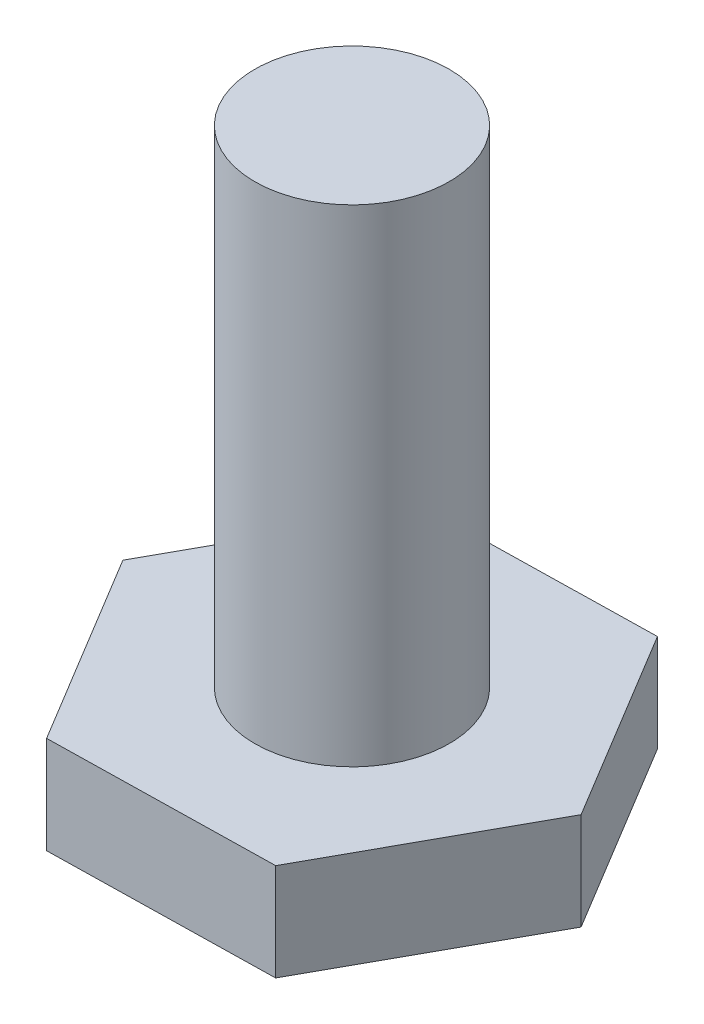
ISO-10303-21;
HEADER;
FILE_DESCRIPTION(('STEP AP214'),'2;1');
FILE_NAME('part.step','',(''),(''),'','','');
FILE_SCHEMA(('AUTOMOTIVE_DESIGN { 1 0 10303 214 1 1 1 1 }'));
ENDSEC;
DATA;
#1=APPLICATION_CONTEXT('core data for automotive mechanical design processes');
#2=APPLICATION_PROTOCOL_DEFINITION('international standard','automotive_design',2000,#1);
#3=PRODUCT_CONTEXT('',#1,'mechanical');
#4=PRODUCT('Part','Part','',(#3));
#5=PRODUCT_RELATED_PRODUCT_CATEGORY('part','',(#4));
#6=PRODUCT_DEFINITION_FORMATION('','',#4);
#7=PRODUCT_DEFINITION_CONTEXT('part definition',#1,'design');
#8=PRODUCT_DEFINITION('design','',#6,#7);
#9=PRODUCT_DEFINITION_SHAPE('','',#8);
#10=(LENGTH_UNIT() NAMED_UNIT(*) SI_UNIT(.MILLI.,.METRE.));
#11=(NAMED_UNIT(*) PLANE_ANGLE_UNIT() SI_UNIT($,.RADIAN.));
#12=(NAMED_UNIT(*) SI_UNIT($,.STERADIAN.) SOLID_ANGLE_UNIT());
#13=UNCERTAINTY_MEASURE_WITH_UNIT(LENGTH_MEASURE(1.E-05),#10,'distance_accuracy_value','');
#14=(GEOMETRIC_REPRESENTATION_CONTEXT(3) GLOBAL_UNCERTAINTY_ASSIGNED_CONTEXT((#13)) GLOBAL_UNIT_ASSIGNED_CONTEXT((#10,
#11,#12)) REPRESENTATION_CONTEXT('',''));
#15=CARTESIAN_POINT('',(0.,0.,0.));
#16=DIRECTION('',(0.,0.,1.));
#17=DIRECTION('',(1.,0.,0.));
#18=AXIS2_PLACEMENT_3D('',#15,#16,#17);
#19=CARTESIAN_POINT('',(-18.8764059971618,10.,12.7106786421223));
#20=DIRECTION('',(0.,-1.,0.));
#21=DIRECTION('',(0.,0.,-1.));
#22=AXIS2_PLACEMENT_3D('',#19,#20,#21);
#23=CYLINDRICAL_SURFACE('',#22,2.);
#24=CARTESIAN_POINT('',(-18.8764059971618,10.,12.7106786421223));
#25=DIRECTION('',(0.,1.,0.));
#26=DIRECTION('',(0.,0.,1.));
#27=AXIS2_PLACEMENT_3D('',#24,#25,#26);
#28=CIRCLE('',#27,2.);
#29=CARTESIAN_POINT('',(-18.8764059971618,10.,14.7106786421223));
#30=VERTEX_POINT('',#29);
#31=EDGE_CURVE('E11',#30,#30,#28,.T.);
#32=ORIENTED_EDGE('',*,*,#31,.F.);
#33=EDGE_LOOP('',(#32));
#34=FACE_BOUND('',#33,.T.);
#35=CARTESIAN_POINT('',(-18.8764059971618,0.,12.7106786421223));
#36=DIRECTION('',(0.,-1.,0.));
#37=DIRECTION('',(0.,0.,-1.));
#38=AXIS2_PLACEMENT_3D('',#35,#36,#37);
#39=CIRCLE('',#38,2.);
#40=CARTESIAN_POINT('',(-18.8764059971618,0.,10.7106786421223));
#41=VERTEX_POINT('',#40);
#42=EDGE_CURVE('E41',#41,#41,#39,.T.);
#43=ORIENTED_EDGE('',*,*,#42,.F.);
#44=EDGE_LOOP('',(#43));
#45=FACE_BOUND('',#44,.T.);
#46=ADVANCED_FACE('F33',(#34,#45),#23,.T.);
#47=CARTESIAN_POINT('',(-18.8764059971618,10.,12.7106786421223));
#48=DIRECTION('',(0.,1.,0.));
#49=DIRECTION('',(0.,0.,1.));
#50=AXIS2_PLACEMENT_3D('',#47,#48,#49);
#51=PLANE('',#50);
#52=ORIENTED_EDGE('',*,*,#31,.T.);
#53=EDGE_LOOP('',(#52));
#54=FACE_BOUND('',#53,.T.);
#55=ADVANCED_FACE('F142',(#54),#51,.T.);
#56=CARTESIAN_POINT('',(-16.4901459386641,0.,16.6653083677163));
#57=DIRECTION('',(0.,-1.,0.));
#58=DIRECTION('',(0.,0.,-1.));
#59=AXIS2_PLACEMENT_3D('',#56,#57,#58);
#60=PLANE('',#59);
#61=DIRECTION('',(-0.483172844711996,0.,0.875524986584002));
#62=VECTOR('',#61,1.);
#63=CARTESIAN_POINT('',(-14.2584661629874,0.,12.6214316742242));
#64=LINE('',#63,#62);
#65=CARTESIAN_POINT('',(-14.2584661629874,0.,12.6214316742242));
#66=VERTEX_POINT('',#65);
#67=CARTESIAN_POINT('',(-16.4901459386641,0.,16.6653083677163));
#68=VERTEX_POINT('',#67);
#69=EDGE_CURVE('E118',#66,#68,#64,.T.);
#70=ORIENTED_EDGE('',*,*,#69,.F.);
#71=DIRECTION('',(0.516640457673778,0.,0.856202451231383));
#72=VECTOR('',#71,1.);
#73=CARTESIAN_POINT('',(-16.6447262214851,0.,8.66680194863014));
#74=LINE('',#73,#72);
#75=CARTESIAN_POINT('',(-16.6447262214851,0.,8.66680194863014));
#76=VERTEX_POINT('',#75);
#77=EDGE_CURVE('E78',#76,#66,#74,.T.);
#78=ORIENTED_EDGE('',*,*,#77,.F.);
#79=DIRECTION('',(0.999813302385774,0.,-0.0193225353526195));
#80=VECTOR('',#79,1.);
#81=CARTESIAN_POINT('',(-21.2626660556594,0.,8.75604891652822));
#82=LINE('',#81,#80);
#83=CARTESIAN_POINT('',(-21.2626660556594,0.,8.75604891652822));
#84=VERTEX_POINT('',#83);
#85=EDGE_CURVE('E72',#84,#76,#82,.T.);
#86=ORIENTED_EDGE('',*,*,#85,.F.);
#87=DIRECTION('',(0.483172844711996,0.,-0.875524986584002));
#88=VECTOR('',#87,1.);
#89=CARTESIAN_POINT('',(-23.4943458313361,0.,12.7999256100204));
#90=LINE('',#89,#88);
#91=CARTESIAN_POINT('',(-23.4943458313361,0.,12.7999256100204));
#92=VERTEX_POINT('',#91);
#93=EDGE_CURVE('E108',#92,#84,#90,.T.);
#94=ORIENTED_EDGE('',*,*,#93,.F.);
#95=DIRECTION('',(-0.516640457673778,0.,-0.856202451231383));
#96=VECTOR('',#95,1.);
#97=CARTESIAN_POINT('',(-21.1080857728385,0.,16.7545553356144));
#98=LINE('',#97,#96);
#99=CARTESIAN_POINT('',(-21.1080857728385,0.,16.7545553356144));
#100=VERTEX_POINT('',#99);
#101=EDGE_CURVE('E123',#100,#92,#98,.T.);
#102=ORIENTED_EDGE('',*,*,#101,.F.);
#103=DIRECTION('',(-0.999813302385774,0.,0.0193225353526199));
#104=VECTOR('',#103,1.);
#105=CARTESIAN_POINT('',(-16.4901459386641,0.,16.6653083677163));
#106=LINE('',#105,#104);
#107=EDGE_CURVE('E121',#68,#100,#106,.T.);
#108=ORIENTED_EDGE('',*,*,#107,.F.);
#109=EDGE_LOOP('',(#70,#78,#86,#94,#102,#108));
#110=FACE_BOUND('',#109,.T.);
#111=ORIENTED_EDGE('',*,*,#42,.T.);
#112=EDGE_LOOP('',(#111));
#113=FACE_BOUND('',#112,.T.);
#114=ADVANCED_FACE('F139',(#110,#113),#60,.F.);
#115=CARTESIAN_POINT('',(-14.2584661629874,-2.,12.6214316742242));
#116=DIRECTION('',(-0.875524986584002,0.,-0.483172844711996));
#117=DIRECTION('',(-0.483172844711996,0.,0.875524986584002));
#118=AXIS2_PLACEMENT_3D('',#115,#116,#117);
#119=PLANE('',#118);
#120=ORIENTED_EDGE('',*,*,#69,.T.);
#121=DIRECTION('',(0.,1.,0.));
#122=VECTOR('',#121,1.);
#123=CARTESIAN_POINT('',(-16.4901459386641,-2.,16.6653083677163));
#124=LINE('',#123,#122);
#125=CARTESIAN_POINT('',(-16.4901459386641,-2.,16.6653083677163));
#126=VERTEX_POINT('',#125);
#127=EDGE_CURVE('E135',#126,#68,#124,.T.);
#128=ORIENTED_EDGE('',*,*,#127,.F.);
#129=DIRECTION('',(-0.483172844711996,0.,0.875524986584002));
#130=VECTOR('',#129,1.);
#131=CARTESIAN_POINT('',(-14.2584661629874,-2.,12.6214316742242));
#132=LINE('',#131,#130);
#133=CARTESIAN_POINT('',(-14.2584661629874,-2.,12.6214316742242));
#134=VERTEX_POINT('',#133);
#135=EDGE_CURVE('E128',#134,#126,#132,.T.);
#136=ORIENTED_EDGE('',*,*,#135,.F.);
#137=DIRECTION('',(0.,1.,0.));
#138=VECTOR('',#137,1.);
#139=CARTESIAN_POINT('',(-14.2584661629874,-2.,12.6214316742242));
#140=LINE('',#139,#138);
#141=EDGE_CURVE('E114',#134,#66,#140,.T.);
#142=ORIENTED_EDGE('',*,*,#141,.T.);
#143=EDGE_LOOP('',(#120,#128,#136,#142));
#144=FACE_BOUND('',#143,.T.);
#145=ADVANCED_FACE('F152',(#144),#119,.F.);
#146=CARTESIAN_POINT('',(-16.4901459386641,-2.,16.6653083677163));
#147=DIRECTION('',(-0.0193225353526199,0.,-0.999813302385774));
#148=DIRECTION('',(-0.999813302385774,0.,0.0193225353526199));
#149=AXIS2_PLACEMENT_3D('',#146,#147,#148);
#150=PLANE('',#149);
#151=ORIENTED_EDGE('',*,*,#107,.T.);
#152=DIRECTION('',(0.,1.,0.));
#153=VECTOR('',#152,1.);
#154=CARTESIAN_POINT('',(-21.1080857728385,-2.,16.7545553356144));
#155=LINE('',#154,#153);
#156=CARTESIAN_POINT('',(-21.1080857728385,-2.,16.7545553356144));
#157=VERTEX_POINT('',#156);
#158=EDGE_CURVE('E132',#157,#100,#155,.T.);
#159=ORIENTED_EDGE('',*,*,#158,.F.);
#160=DIRECTION('',(-0.999813302385774,0.,0.0193225353526199));
#161=VECTOR('',#160,1.);
#162=CARTESIAN_POINT('',(-16.4901459386641,-2.,16.6653083677163));
#163=LINE('',#162,#161);
#164=EDGE_CURVE('E87',#126,#157,#163,.T.);
#165=ORIENTED_EDGE('',*,*,#164,.F.);
#166=ORIENTED_EDGE('',*,*,#127,.T.);
#167=EDGE_LOOP('',(#151,#159,#165,#166));
#168=FACE_BOUND('',#167,.T.);
#169=ADVANCED_FACE('F158',(#168),#150,.F.);
#170=CARTESIAN_POINT('',(-21.1080857728385,-2.,16.7545553356144));
#171=DIRECTION('',(0.856202451231383,0.,-0.516640457673778));
#172=DIRECTION('',(-0.516640457673778,0.,-0.856202451231383));
#173=AXIS2_PLACEMENT_3D('',#170,#171,#172);
#174=PLANE('',#173);
#175=ORIENTED_EDGE('',*,*,#101,.T.);
#176=DIRECTION('',(0.,1.,0.));
#177=VECTOR('',#176,1.);
#178=CARTESIAN_POINT('',(-23.4943458313361,-2.,12.7999256100204));
#179=LINE('',#178,#177);
#180=CARTESIAN_POINT('',(-23.4943458313361,-2.,12.7999256100204));
#181=VERTEX_POINT('',#180);
#182=EDGE_CURVE('E109',#181,#92,#179,.T.);
#183=ORIENTED_EDGE('',*,*,#182,.F.);
#184=DIRECTION('',(-0.516640457673778,0.,-0.856202451231383));
#185=VECTOR('',#184,1.);
#186=CARTESIAN_POINT('',(-21.1080857728385,-2.,16.7545553356144));
#187=LINE('',#186,#185);
#188=EDGE_CURVE('E100',#157,#181,#187,.T.);
#189=ORIENTED_EDGE('',*,*,#188,.F.);
#190=ORIENTED_EDGE('',*,*,#158,.T.);
#191=EDGE_LOOP('',(#175,#183,#189,#190));
#192=FACE_BOUND('',#191,.T.);
#193=ADVANCED_FACE('F162',(#192),#174,.F.);
#194=CARTESIAN_POINT('',(-23.4943458313361,-2.,12.7999256100204));
#195=DIRECTION('',(0.875524986584002,0.,0.483172844711996));
#196=DIRECTION('',(0.483172844711996,0.,-0.875524986584003));
#197=AXIS2_PLACEMENT_3D('',#194,#195,#196);
#198=PLANE('',#197);
#199=ORIENTED_EDGE('',*,*,#93,.T.);
#200=DIRECTION('',(0.,1.,0.));
#201=VECTOR('',#200,1.);
#202=CARTESIAN_POINT('',(-21.2626660556594,-2.,8.75604891652822));
#203=LINE('',#202,#201);
#204=CARTESIAN_POINT('',(-21.2626660556594,-2.,8.75604891652822));
#205=VERTEX_POINT('',#204);
#206=EDGE_CURVE('E105',#205,#84,#203,.T.);
#207=ORIENTED_EDGE('',*,*,#206,.F.);
#208=DIRECTION('',(0.483172844711996,0.,-0.875524986584002));
#209=VECTOR('',#208,1.);
#210=CARTESIAN_POINT('',(-23.4943458313361,-2.,12.7999256100204));
#211=LINE('',#210,#209);
#212=EDGE_CURVE('E94',#181,#205,#211,.T.);
#213=ORIENTED_EDGE('',*,*,#212,.F.);
#214=ORIENTED_EDGE('',*,*,#182,.T.);
#215=EDGE_LOOP('',(#199,#207,#213,#214));
#216=FACE_BOUND('',#215,.T.);
#217=ADVANCED_FACE('F106',(#216),#198,.F.);
#218=CARTESIAN_POINT('',(-21.2626660556594,-2.,8.75604891652822));
#219=DIRECTION('',(0.0193225353526195,0.,0.999813302385774));
#220=DIRECTION('',(0.999813302385774,0.,-0.0193225353526195));
#221=AXIS2_PLACEMENT_3D('',#218,#219,#220);
#222=PLANE('',#221);
#223=ORIENTED_EDGE('',*,*,#85,.T.);
#224=DIRECTION('',(0.,1.,0.));
#225=VECTOR('',#224,1.);
#226=CARTESIAN_POINT('',(-16.6447262214851,-2.,8.66680194863014));
#227=LINE('',#226,#225);
#228=CARTESIAN_POINT('',(-16.6447262214851,-2.,8.66680194863014));
#229=VERTEX_POINT('',#228);
#230=EDGE_CURVE('E110',#229,#76,#227,.T.);
#231=ORIENTED_EDGE('',*,*,#230,.F.);
#232=DIRECTION('',(0.999813302385774,0.,-0.0193225353526195));
#233=VECTOR('',#232,1.);
#234=CARTESIAN_POINT('',(-21.2626660556594,-2.,8.75604891652822));
#235=LINE('',#234,#233);
#236=EDGE_CURVE('E98',#205,#229,#235,.T.);
#237=ORIENTED_EDGE('',*,*,#236,.F.);
#238=ORIENTED_EDGE('',*,*,#206,.T.);
#239=EDGE_LOOP('',(#223,#231,#237,#238));
#240=FACE_BOUND('',#239,.T.);
#241=ADVANCED_FACE('F112',(#240),#222,.F.);
#242=CARTESIAN_POINT('',(-16.6447262214851,-2.,8.66680194863014));
#243=DIRECTION('',(-0.856202451231383,0.,0.516640457673778));
#244=DIRECTION('',(0.516640457673778,0.,0.856202451231383));
#245=AXIS2_PLACEMENT_3D('',#242,#243,#244);
#246=PLANE('',#245);
#247=ORIENTED_EDGE('',*,*,#77,.T.);
#248=ORIENTED_EDGE('',*,*,#141,.F.);
#249=DIRECTION('',(0.516640457673778,0.,0.856202451231383));
#250=VECTOR('',#249,1.);
#251=CARTESIAN_POINT('',(-16.6447262214851,-2.,8.66680194863014));
#252=LINE('',#251,#250);
#253=EDGE_CURVE('E49',#229,#134,#252,.T.);
#254=ORIENTED_EDGE('',*,*,#253,.F.);
#255=ORIENTED_EDGE('',*,*,#230,.T.);
#256=EDGE_LOOP('',(#247,#248,#254,#255));
#257=FACE_BOUND('',#256,.T.);
#258=ADVANCED_FACE('F170',(#257),#246,.F.);
#259=CARTESIAN_POINT('',(-16.4901459386641,-2.,16.6653083677163));
#260=DIRECTION('',(0.,-1.,0.));
#261=DIRECTION('',(0.,0.,-1.));
#262=AXIS2_PLACEMENT_3D('',#259,#260,#261);
#263=PLANE('',#262);
#264=ORIENTED_EDGE('',*,*,#135,.T.);
#265=ORIENTED_EDGE('',*,*,#164,.T.);
#266=ORIENTED_EDGE('',*,*,#188,.T.);
#267=ORIENTED_EDGE('',*,*,#212,.T.);
#268=ORIENTED_EDGE('',*,*,#236,.T.);
#269=ORIENTED_EDGE('',*,*,#253,.T.);
#270=EDGE_LOOP('',(#264,#265,#266,#267,#268,#269));
#271=FACE_BOUND('',#270,.T.);
#272=ADVANCED_FACE('F96',(#271),#263,.T.);
#273=CLOSED_SHELL('',(#46,#55,#114,#145,#169,#193,#217,#241,#258,#272));
#274=MANIFOLD_SOLID_BREP('B2',#273);
#275=ADVANCED_BREP_SHAPE_REPRESENTATION('',(#18,#274),#14);
#276=SHAPE_DEFINITION_REPRESENTATION(#9,#275);
ENDSEC;
END-ISO-10303-21;
